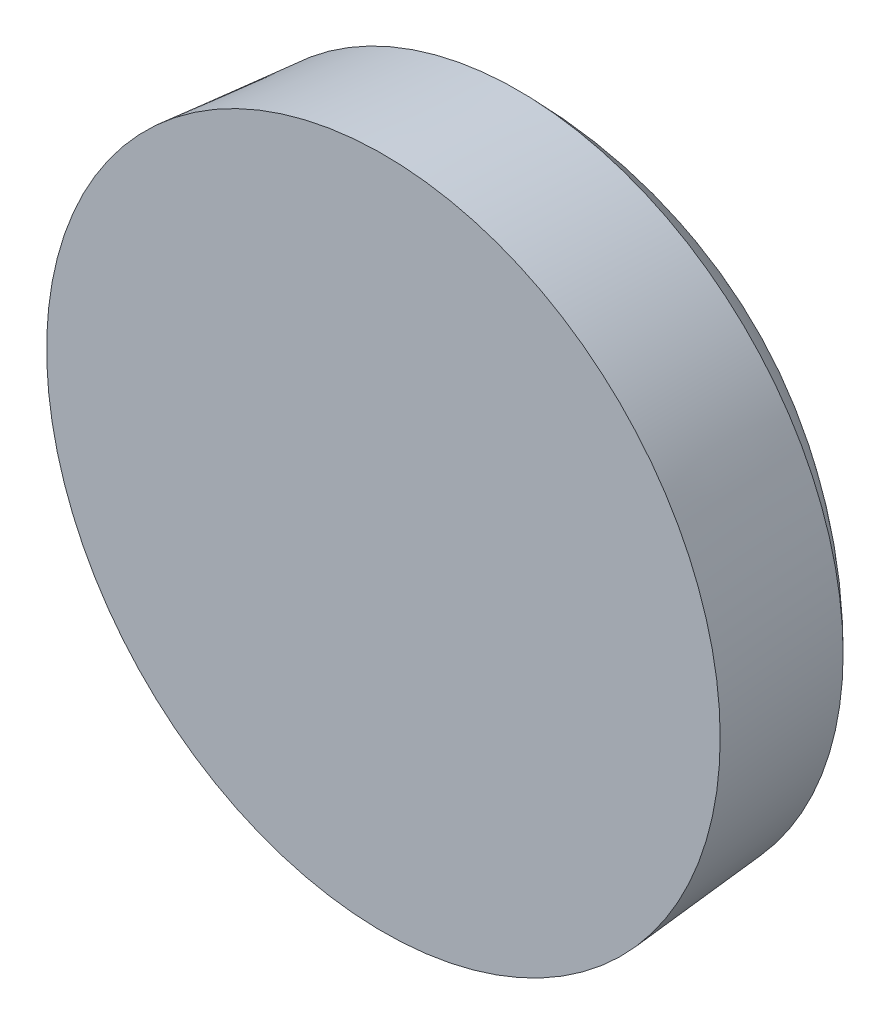
ISO-10303-21;
HEADER;
FILE_DESCRIPTION(('STEP AP214'),'2;1');
FILE_NAME('part.step','',(''),(''),'','','');
FILE_SCHEMA(('AUTOMOTIVE_DESIGN { 1 0 10303 214 1 1 1 1 }'));
ENDSEC;
DATA;
#1=APPLICATION_CONTEXT('core data for automotive mechanical design processes');
#2=APPLICATION_PROTOCOL_DEFINITION('international standard','automotive_design',2000,#1);
#3=PRODUCT_CONTEXT('',#1,'mechanical');
#4=PRODUCT('Part','Part','',(#3));
#5=PRODUCT_RELATED_PRODUCT_CATEGORY('part','',(#4));
#6=PRODUCT_DEFINITION_FORMATION('','',#4);
#7=PRODUCT_DEFINITION_CONTEXT('part definition',#1,'design');
#8=PRODUCT_DEFINITION('design','',#6,#7);
#9=PRODUCT_DEFINITION_SHAPE('','',#8);
#10=(LENGTH_UNIT() NAMED_UNIT(*) SI_UNIT(.MILLI.,.METRE.));
#11=(NAMED_UNIT(*) PLANE_ANGLE_UNIT() SI_UNIT($,.RADIAN.));
#12=(NAMED_UNIT(*) SI_UNIT($,.STERADIAN.) SOLID_ANGLE_UNIT());
#13=UNCERTAINTY_MEASURE_WITH_UNIT(LENGTH_MEASURE(1.E-05),#10,'distance_accuracy_value','');
#14=(GEOMETRIC_REPRESENTATION_CONTEXT(3) GLOBAL_UNCERTAINTY_ASSIGNED_CONTEXT((#13)) GLOBAL_UNIT_ASSIGNED_CONTEXT((#10,
#11,#12)) REPRESENTATION_CONTEXT('',''));
#15=CARTESIAN_POINT('',(0.,0.,0.));
#16=DIRECTION('',(0.,0.,1.));
#17=DIRECTION('',(1.,0.,0.));
#18=AXIS2_PLACEMENT_3D('',#15,#16,#17);
#19=CARTESIAN_POINT('',(-6.89997712496555,4.50501230247056,-21.6));
#20=DIRECTION('',(0.,0.,-1.));
#21=DIRECTION('',(0.,1.,0.));
#22=AXIS2_PLACEMENT_3D('',#19,#20,#21);
#23=PLANE('',#22);
#24=DIRECTION('',(0.747876143588401,0.66383828893138,0.));
#25=VECTOR('',#24,1.);
#26=CARTESIAN_POINT('',(-7.0194680169732,4.63963000831647,-21.6));
#27=LINE('',#26,#25);
#28=CARTESIAN_POINT('',(-7.15408572281911,4.52013911630882,-21.6));
#29=VERTEX_POINT('',#28);
#30=CARTESIAN_POINT('',(-7.72995035338218,4.00898363383166,-21.6));
#31=VERTEX_POINT('',#30);
#32=EDGE_CURVE('E84',#29,#31,#27,.F.);
#33=ORIENTED_EDGE('',*,*,#32,.F.);
#34=DIRECTION('',(-0.66383828893138,0.747876143588401,0.));
#35=VECTOR('',#34,1.);
#36=CARTESIAN_POINT('',(-7.03459483081146,4.38552141046291,-21.6));
#37=LINE('',#36,#35);
#38=CARTESIAN_POINT('',(-7.66524120529627,5.09600374687189,-21.6));
#39=VERTEX_POINT('',#38);
#40=EDGE_CURVE('E89',#39,#29,#37,.F.);
#41=ORIENTED_EDGE('',*,*,#40,.F.);
#42=DIRECTION('',(0.747876143588401,0.66383828893138,0.));
#43=VECTOR('',#42,1.);
#44=CARTESIAN_POINT('',(-7.53062349945036,5.21549463887954,-21.6));
#45=LINE('',#44,#43);
#46=CARTESIAN_POINT('',(-7.39600579360445,5.33498553088719,-21.6));
#47=VERTEX_POINT('',#46);
#48=EDGE_CURVE('E140',#47,#39,#45,.F.);
#49=ORIENTED_EDGE('',*,*,#48,.F.);
#50=DIRECTION('',(0.66383828893138,-0.747876143588401,0.));
#51=VECTOR('',#50,1.);
#52=CARTESIAN_POINT('',(-6.76535941911964,4.62450319447821,-21.6));
#53=LINE('',#52,#51);
#54=CARTESIAN_POINT('',(-6.88485031112729,4.75912090032412,-21.6));
#55=VERTEX_POINT('',#54);
#56=EDGE_CURVE('E151',#55,#47,#53,.F.);
#57=ORIENTED_EDGE('',*,*,#56,.F.);
#58=DIRECTION('',(0.747876143588401,0.66383828893138,0.));
#59=VECTOR('',#58,1.);
#60=CARTESIAN_POINT('',(-7.0194680169732,4.63963000831647,-21.6));
#61=LINE('',#60,#59);
#62=CARTESIAN_POINT('',(-6.30898568056422,5.27027638280128,-21.6));
#63=VERTEX_POINT('',#62);
#64=EDGE_CURVE('E154',#63,#55,#61,.F.);
#65=ORIENTED_EDGE('',*,*,#64,.F.);
#66=DIRECTION('',(0.66383828893138,-0.747876143588401,0.));
#67=VECTOR('',#66,1.);
#68=CARTESIAN_POINT('',(-6.18949478855657,5.13565867695537,-21.6));
#69=LINE('',#68,#67);
#70=CARTESIAN_POINT('',(-6.07000389654892,5.00104097110946,-21.6));
#71=VERTEX_POINT('',#70);
#72=EDGE_CURVE('E162',#71,#63,#69,.F.);
#73=ORIENTED_EDGE('',*,*,#72,.F.);
#74=DIRECTION('',(-0.747876143588401,-0.66383828893138,0.));
#75=VECTOR('',#74,1.);
#76=CARTESIAN_POINT('',(-6.7804862329579,4.37039459662465,-21.6));
#77=LINE('',#76,#75);
#78=CARTESIAN_POINT('',(-6.64586852711199,4.4898854886323,-21.6));
#79=VERTEX_POINT('',#78);
#80=EDGE_CURVE('E167',#79,#71,#77,.F.);
#81=ORIENTED_EDGE('',*,*,#80,.F.);
#82=DIRECTION('',(0.66383828893138,-0.747876143588401,0.));
#83=VECTOR('',#82,1.);
#84=CARTESIAN_POINT('',(-6.76535941911964,4.62450319447821,-21.6));
#85=LINE('',#84,#83);
#86=CARTESIAN_POINT('',(-6.13471304463483,3.91402085806923,-21.6));
#87=VERTEX_POINT('',#86);
#88=EDGE_CURVE('E172',#87,#79,#85,.F.);
#89=ORIENTED_EDGE('',*,*,#88,.F.);
#90=DIRECTION('',(0.747876143588401,0.66383828893138,0.));
#91=VECTOR('',#90,1.);
#92=CARTESIAN_POINT('',(-6.26933075048074,3.79452996606158,-21.6));
#93=LINE('',#92,#91);
#94=CARTESIAN_POINT('',(-6.40394845632666,3.67503907405393,-21.6));
#95=VERTEX_POINT('',#94);
#96=EDGE_CURVE('E178',#87,#95,#93,.F.);
#97=ORIENTED_EDGE('',*,*,#96,.T.);
#98=DIRECTION('',(-0.66383828893138,0.747876143588401,0.));
#99=VECTOR('',#98,1.);
#100=CARTESIAN_POINT('',(-7.03459483081146,4.38552141046291,-21.6));
#101=LINE('',#100,#99);
#102=CARTESIAN_POINT('',(-6.91510393880381,4.250903704617,-21.6));
#103=VERTEX_POINT('',#102);
#104=EDGE_CURVE('E183',#103,#95,#101,.F.);
#105=ORIENTED_EDGE('',*,*,#104,.F.);
#106=DIRECTION('',(-0.747876143588401,-0.66383828893138,0.));
#107=VECTOR('',#106,1.);
#108=CARTESIAN_POINT('',(-6.7804862329579,4.37039459662465,-21.6));
#109=LINE('',#108,#107);
#110=CARTESIAN_POINT('',(-7.49096856936688,3.73974822213984,-21.6));
#111=VERTEX_POINT('',#110);
#112=EDGE_CURVE('E119',#111,#103,#109,.F.);
#113=ORIENTED_EDGE('',*,*,#112,.F.);
#114=DIRECTION('',(0.66383828893138,-0.747876143588401,0.));
#115=VECTOR('',#114,1.);
#116=CARTESIAN_POINT('',(-7.61045946137453,3.87436592798575,-21.6));
#117=LINE('',#116,#115);
#118=EDGE_CURVE('E117',#111,#31,#117,.F.);
#119=ORIENTED_EDGE('',*,*,#118,.T.);
#120=EDGE_LOOP('',(#33,#41,#49,#57,#65,#73,#81,#89,#97,#105,#113,#119));
#121=FACE_BOUND('',#120,.T.);
#122=ADVANCED_FACE('F17',(#121),#23,.T.);
#123=CARTESIAN_POINT('',(-7.0194680169732,4.63963000831647,-22.2));
#124=DIRECTION('',(0.66383828893138,-0.747876143588401,0.));
#125=DIRECTION('',(0.747876143588401,0.66383828893138,0.));
#126=AXIS2_PLACEMENT_3D('',#123,#124,#125);
#127=PLANE('',#126);
#128=DIRECTION('',(0.,0.,1.));
#129=VECTOR('',#128,1.);
#130=CARTESIAN_POINT('',(-7.15408572281911,4.52013911630882,-22.2));
#131=LINE('',#130,#129);
#132=CARTESIAN_POINT('',(-7.15408572281911,4.52013911630882,-22.788097569794));
#133=VERTEX_POINT('',#132);
#134=EDGE_CURVE('E127',#29,#133,#131,.F.);
#135=ORIENTED_EDGE('',*,*,#134,.F.);
#136=ORIENTED_EDGE('',*,*,#32,.T.);
#137=DIRECTION('',(0.,0.,1.));
#138=VECTOR('',#137,1.);
#139=CARTESIAN_POINT('',(-7.72995035338218,4.00898363383166,-22.2));
#140=LINE('',#139,#138);
#141=CARTESIAN_POINT('',(-7.72995035338218,4.00898363383166,-22.6229045231911));
#142=VERTEX_POINT('',#141);
#143=EDGE_CURVE('E123',#31,#142,#140,.F.);
#144=ORIENTED_EDGE('',*,*,#143,.T.);
#145=CARTESIAN_POINT('',(-7.15408572281911,4.52013911630882,-22.788097569794));
#146=CARTESIAN_POINT('',(-7.178771656599,4.49822710830909,-22.7859104299673));
#147=CARTESIAN_POINT('',(-7.20342772135599,4.47634161298961,-22.7831210421487));
#148=CARTESIAN_POINT('',(-7.25255070327682,4.43273851567851,-22.7763560552392));
#149=CARTESIAN_POINT('',(-7.27701798297534,4.41102059188977,-22.7723851623111));
#150=CARTESIAN_POINT('',(-7.32576464164366,4.36775153088425,-22.7632701136372));
#151=CARTESIAN_POINT('',(-7.35004434494988,4.3462001057763,-22.7581290588921));
#152=CARTESIAN_POINT('',(-7.39841672115628,4.30326326960671,-22.7466823115268));
#153=CARTESIAN_POINT('',(-7.42250959829504,4.2818776772565,-22.7403781619621));
#154=CARTESIAN_POINT('',(-7.47050909335735,4.23927182206925,-22.7266089835755));
#155=CARTESIAN_POINT('',(-7.49441571128089,4.2180515592322,-22.7191439547536));
#156=CARTESIAN_POINT('',(-7.5420428123996,4.17577625257286,-22.703052205587));
#157=CARTESIAN_POINT('',(-7.56576300849104,4.15472146359282,-22.6944239659575));
#158=CARTESIAN_POINT('',(-7.61301615058749,4.11277809467423,-22.6760004253173));
#159=CARTESIAN_POINT('',(-7.63654844108106,4.09189009658817,-22.666202118307));
#160=CARTESIAN_POINT('',(-7.68342385204351,4.05028201365486,-22.6454289197685));
#161=CARTESIAN_POINT('',(-7.70676585941599,4.02956291682684,-22.6344495373844));
#162=CARTESIAN_POINT('',(-7.72995035338216,4.00898363383167,-22.622904523191));
#163=B_SPLINE_CURVE_WITH_KNOTS('',3,(#145,#146,#147,#148,#149,#150,#151,#152,#153,#154,#155,
#156,#157,#158,#159,#160,#161,#162),.UNSPECIFIED.,.F.,.F.,(4,2,2,2,2,2,2,2,4),(0.,
0.0992357442434152,0.198081387639265,0.296668072480489,0.395124892694088,0.493581712907687,
0.592168397748912,0.69101404114476,0.790249785388176),.UNSPECIFIED.);
#164=EDGE_CURVE('E20',#133,#142,#163,.T.);
#165=ORIENTED_EDGE('',*,*,#164,.F.);
#166=EDGE_LOOP('',(#135,#136,#144,#165));
#167=FACE_BOUND('',#166,.T.);
#168=ADVANCED_FACE('F125',(#167),#127,.T.);
#169=CARTESIAN_POINT('',(-7.61045946137453,3.87436592798575,-22.2));
#170=DIRECTION('',(-0.747876143588401,-0.66383828893138,0.));
#171=DIRECTION('',(0.66383828893138,-0.747876143588401,0.));
#172=AXIS2_PLACEMENT_3D('',#169,#170,#171);
#173=PLANE('',#172);
#174=ORIENTED_EDGE('',*,*,#118,.F.);
#175=DIRECTION('',(0.,0.,1.));
#176=VECTOR('',#175,1.);
#177=CARTESIAN_POINT('',(-7.49096856936688,3.73974822213984,-22.2));
#178=LINE('',#177,#176);
#179=CARTESIAN_POINT('',(-7.49096856936687,3.73974822213984,-22.6229045231911));
#180=VERTEX_POINT('',#179);
#181=EDGE_CURVE('E132',#180,#111,#178,.T.);
#182=ORIENTED_EDGE('',*,*,#181,.F.);
#183=CARTESIAN_POINT('',(-7.72995035338218,4.00898363383166,-22.622904523191));
#184=CARTESIAN_POINT('',(-7.6901200560463,3.96411106521635,-22.6271329188894));
#185=CARTESIAN_POINT('',(-7.65028975871041,3.91923849660105,-22.6292471167385));
#186=CARTESIAN_POINT('',(-7.57062916403865,3.82949335937045,-22.6292471167385));
#187=CARTESIAN_POINT('',(-7.53079886670276,3.78462079075515,-22.6271329188894));
#188=CARTESIAN_POINT('',(-7.49096856936688,3.73974822213984,-22.622904523191));
#189=B_SPLINE_CURVE_WITH_KNOTS('',3,(#183,#184,#185,#186,#187,#188),.UNSPECIFIED.,.F.,.F.,(4,2,
4),(0.,0.180111711148685,0.36022342229737),.UNSPECIFIED.);
#190=EDGE_CURVE('E131',#142,#180,#189,.T.);
#191=ORIENTED_EDGE('',*,*,#190,.F.);
#192=ORIENTED_EDGE('',*,*,#143,.F.);
#193=EDGE_LOOP('',(#174,#182,#191,#192));
#194=FACE_BOUND('',#193,.T.);
#195=ADVANCED_FACE('F129',(#194),#173,.F.);
#196=CARTESIAN_POINT('',(-6.7804862329579,4.37039459662465,-22.2));
#197=DIRECTION('',(-0.66383828893138,0.747876143588401,0.));
#198=DIRECTION('',(-0.747876143588401,-0.66383828893138,0.));
#199=AXIS2_PLACEMENT_3D('',#196,#197,#198);
#200=PLANE('',#199);
#201=DIRECTION('',(0.,0.,1.));
#202=VECTOR('',#201,1.);
#203=CARTESIAN_POINT('',(-6.91510393880381,4.250903704617,-22.2));
#204=LINE('',#203,#202);
#205=CARTESIAN_POINT('',(-6.91510393880381,4.250903704617,-22.788097569794));
#206=VERTEX_POINT('',#205);
#207=EDGE_CURVE('E180',#206,#103,#204,.T.);
#208=ORIENTED_EDGE('',*,*,#207,.F.);
#209=CARTESIAN_POINT('',(-7.49096856936686,3.73974822213985,-22.622904523191));
#210=CARTESIAN_POINT('',(-7.46778407540069,3.76032750513502,-22.6344495373844));
#211=CARTESIAN_POINT('',(-7.44444206802821,3.78104660196304,-22.6454289197685));
#212=CARTESIAN_POINT('',(-7.39756665706576,3.82265468489635,-22.666202118307));
#213=CARTESIAN_POINT('',(-7.37403436657219,3.84354268298241,-22.6760004253173));
#214=CARTESIAN_POINT('',(-7.32678122447574,3.885486051901,-22.6944239659575));
#215=CARTESIAN_POINT('',(-7.3030610283843,3.90654084088104,-22.703052205587));
#216=CARTESIAN_POINT('',(-7.25543392726559,3.94881614754038,-22.7191439547536));
#217=CARTESIAN_POINT('',(-7.23152730934205,3.97003641037742,-22.7266089835755));
#218=CARTESIAN_POINT('',(-7.18352781427975,4.01264226556468,-22.7403781619621));
#219=CARTESIAN_POINT('',(-7.15943493714099,4.03402785791489,-22.7466823115268));
#220=CARTESIAN_POINT('',(-7.11106256093458,4.07696469408448,-22.7581290588921));
#221=CARTESIAN_POINT('',(-7.08678285762836,4.09851611919243,-22.7632701136372));
#222=CARTESIAN_POINT('',(-7.03803619896004,4.14178518019794,-22.7723851623111));
#223=CARTESIAN_POINT('',(-7.01356891926152,4.16350310398668,-22.7763560552392));
#224=CARTESIAN_POINT('',(-6.96444593734069,4.20710620129778,-22.7831210421487));
#225=CARTESIAN_POINT('',(-6.93978987258371,4.22899169661726,-22.7859104299673));
#226=CARTESIAN_POINT('',(-6.91510393880381,4.250903704617,-22.788097569794));
#227=B_SPLINE_CURVE_WITH_KNOTS('',3,(#209,#210,#211,#212,#213,#214,#215,#216,#217,#218,#219,
#220,#221,#222,#223,#224,#225,#226),.UNSPECIFIED.,.F.,.F.,(4,2,2,2,2,2,2,2,4),(0.,
0.0992357442434142,0.198081387639263,0.296668072480487,0.395124892694086,0.493581712907683,
0.592168397748908,0.691014041144757,0.790249785388171),.UNSPECIFIED.);
#228=EDGE_CURVE('E296',#180,#206,#227,.T.);
#229=ORIENTED_EDGE('',*,*,#228,.F.);
#230=ORIENTED_EDGE('',*,*,#181,.T.);
#231=ORIENTED_EDGE('',*,*,#112,.T.);
#232=EDGE_LOOP('',(#208,#229,#230,#231));
#233=FACE_BOUND('',#232,.T.);
#234=ADVANCED_FACE('F305',(#233),#200,.T.);
#235=CARTESIAN_POINT('',(-7.03459483081146,4.38552141046291,-22.2));
#236=DIRECTION('',(0.747876143588401,0.66383828893138,0.));
#237=DIRECTION('',(-0.66383828893138,0.747876143588401,0.));
#238=AXIS2_PLACEMENT_3D('',#235,#236,#237);
#239=PLANE('',#238);
#240=CARTESIAN_POINT('',(-6.91510393880381,4.250903704617,-22.788097569794));
#241=CARTESIAN_POINT('',(-6.89319193080408,4.2262177708371,-22.7859104299673));
#242=CARTESIAN_POINT('',(-6.8713064354846,4.20156170608012,-22.7831210421487));
#243=CARTESIAN_POINT('',(-6.8277033381735,4.15243872415929,-22.7763560552392));
#244=CARTESIAN_POINT('',(-6.80598541438476,4.12797144446077,-22.7723851623111));
#245=CARTESIAN_POINT('',(-6.76271635337924,4.07922478579245,-22.7632701136372));
#246=CARTESIAN_POINT('',(-6.7411649282713,4.05494508248623,-22.7581290588921));
#247=CARTESIAN_POINT('',(-6.6982280921017,4.00657270627982,-22.7466823115268));
#248=CARTESIAN_POINT('',(-6.67684249975149,3.98247982914107,-22.740378161962));
#249=CARTESIAN_POINT('',(-6.63423664456424,3.93448033407876,-22.7266089835755));
#250=CARTESIAN_POINT('',(-6.61301638172719,3.91057371615522,-22.7191439547536));
#251=CARTESIAN_POINT('',(-6.57074107506785,3.86294661503651,-22.703052205587));
#252=CARTESIAN_POINT('',(-6.54968628608781,3.83922641894507,-22.6944239659575));
#253=CARTESIAN_POINT('',(-6.50774291716923,3.79197327684862,-22.6760004253173));
#254=CARTESIAN_POINT('',(-6.48685491908316,3.76844098635505,-22.666202118307));
#255=CARTESIAN_POINT('',(-6.44524683614985,3.7215655753926,-22.6454289197685));
#256=CARTESIAN_POINT('',(-6.42452773932184,3.69822356802012,-22.6344495373844));
#257=CARTESIAN_POINT('',(-6.40394845632667,3.67503907405395,-22.622904523191));
#258=B_SPLINE_CURVE_WITH_KNOTS('',3,(#240,#241,#242,#243,#244,#245,#246,#247,#248,#249,#250,
#251,#252,#253,#254,#255,#256,#257),.UNSPECIFIED.,.F.,.F.,(4,2,2,2,2,2,2,2,4),(0.,
0.0992357442434143,0.198081387639264,0.296668072480489,0.395124892694086,0.493581712907685,
0.592168397748908,0.691014041144757,0.790249785388172),.UNSPECIFIED.);
#259=CARTESIAN_POINT('',(-6.40394845632665,3.67503907405393,-22.6229045231911));
#260=VERTEX_POINT('',#259);
#261=EDGE_CURVE('E289',#206,#260,#258,.T.);
#262=ORIENTED_EDGE('',*,*,#261,.F.);
#263=ORIENTED_EDGE('',*,*,#207,.T.);
#264=ORIENTED_EDGE('',*,*,#104,.T.);
#265=DIRECTION('',(0.,0.,1.));
#266=VECTOR('',#265,1.);
#267=CARTESIAN_POINT('',(-6.40394845632666,3.67503907405393,-22.2));
#268=LINE('',#267,#266);
#269=EDGE_CURVE('E175',#95,#260,#268,.F.);
#270=ORIENTED_EDGE('',*,*,#269,.T.);
#271=EDGE_LOOP('',(#262,#263,#264,#270));
#272=FACE_BOUND('',#271,.T.);
#273=ADVANCED_FACE('F302',(#272),#239,.T.);
#274=CARTESIAN_POINT('',(-6.26933075048074,3.79452996606158,-22.2));
#275=DIRECTION('',(0.66383828893138,-0.747876143588401,0.));
#276=DIRECTION('',(0.747876143588401,0.66383828893138,0.));
#277=AXIS2_PLACEMENT_3D('',#274,#275,#276);
#278=PLANE('',#277);
#279=ORIENTED_EDGE('',*,*,#96,.F.);
#280=DIRECTION('',(0.,0.,1.));
#281=VECTOR('',#280,1.);
#282=CARTESIAN_POINT('',(-6.13471304463483,3.91402085806923,-22.2));
#283=LINE('',#282,#281);
#284=CARTESIAN_POINT('',(-6.13471304463484,3.91402085806924,-22.6229045231911));
#285=VERTEX_POINT('',#284);
#286=EDGE_CURVE('E174',#285,#87,#283,.T.);
#287=ORIENTED_EDGE('',*,*,#286,.F.);
#288=CARTESIAN_POINT('',(-6.40394845632665,3.67503907405394,-22.622904523191));
#289=CARTESIAN_POINT('',(-6.35907588771134,3.71486937138982,-22.6271329188894));
#290=CARTESIAN_POINT('',(-6.31420331909604,3.7546996687257,-22.6292471167385));
#291=CARTESIAN_POINT('',(-6.22445818186544,3.83436026339746,-22.6292471167385));
#292=CARTESIAN_POINT('',(-6.17958561325013,3.87419056073334,-22.6271329188894));
#293=CARTESIAN_POINT('',(-6.13471304463483,3.91402085806922,-22.622904523191));
#294=B_SPLINE_CURVE_WITH_KNOTS('',3,(#288,#289,#290,#291,#292,#293),.UNSPECIFIED.,.F.,.F.,(4,2,
4),(0.,0.180111711148683,0.360223422297366),.UNSPECIFIED.);
#295=EDGE_CURVE('E282',#260,#285,#294,.T.);
#296=ORIENTED_EDGE('',*,*,#295,.F.);
#297=ORIENTED_EDGE('',*,*,#269,.F.);
#298=EDGE_LOOP('',(#279,#287,#296,#297));
#299=FACE_BOUND('',#298,.T.);
#300=ADVANCED_FACE('F271',(#299),#278,.F.);
#301=CARTESIAN_POINT('',(-6.76535941911964,4.62450319447821,-22.2));
#302=DIRECTION('',(-0.747876143588401,-0.66383828893138,0.));
#303=DIRECTION('',(0.66383828893138,-0.747876143588401,0.));
#304=AXIS2_PLACEMENT_3D('',#301,#302,#303);
#305=PLANE('',#304);
#306=CARTESIAN_POINT('',(-6.13471304463484,3.91402085806925,-22.622904523191));
#307=CARTESIAN_POINT('',(-6.15529232763002,3.93720535203542,-22.6344495373844));
#308=CARTESIAN_POINT('',(-6.17601142445803,3.9605473594079,-22.6454289197685));
#309=CARTESIAN_POINT('',(-6.21761950739134,4.00742277037035,-22.666202118307));
#310=CARTESIAN_POINT('',(-6.23850750547741,4.03095506086392,-22.6760004253173));
#311=CARTESIAN_POINT('',(-6.28045087439599,4.07820820296037,-22.6944239659575));
#312=CARTESIAN_POINT('',(-6.30150566337603,4.10192839905181,-22.703052205587));
#313=CARTESIAN_POINT('',(-6.34378097003537,4.14955550017052,-22.7191439547536));
#314=CARTESIAN_POINT('',(-6.36500123287242,4.17346211809406,-22.7266089835755));
#315=CARTESIAN_POINT('',(-6.40760708805967,4.22146161315637,-22.740378161962));
#316=CARTESIAN_POINT('',(-6.42899268040988,4.24555449029512,-22.7466823115268));
#317=CARTESIAN_POINT('',(-6.47192951657947,4.29392686650153,-22.7581290588921));
#318=CARTESIAN_POINT('',(-6.49348094168742,4.31820656980775,-22.7632701136372));
#319=CARTESIAN_POINT('',(-6.53675000269294,4.36695322847607,-22.7723851623111));
#320=CARTESIAN_POINT('',(-6.55846792648168,4.39142050817459,-22.7763560552392));
#321=CARTESIAN_POINT('',(-6.60207102379277,4.44054349009542,-22.7831210421487));
#322=CARTESIAN_POINT('',(-6.62395651911226,4.4651995548524,-22.7859104299673));
#323=CARTESIAN_POINT('',(-6.64586852711199,4.4898854886323,-22.788097569794));
#324=B_SPLINE_CURVE_WITH_KNOTS('',3,(#306,#307,#308,#309,#310,#311,#312,#313,#314,#315,#316,
#317,#318,#319,#320,#321,#322,#323),.UNSPECIFIED.,.F.,.F.,(4,2,2,2,2,2,2,2,4),(0.,
0.0992357442434162,0.198081387639263,0.296668072480487,0.395124892694085,0.493581712907681,
0.592168397748907,0.691014041144756,0.790249785388171),.UNSPECIFIED.);
#325=CARTESIAN_POINT('',(-6.64586852711199,4.4898854886323,-22.788097569794));
#326=VERTEX_POINT('',#325);
#327=EDGE_CURVE('E275',#285,#326,#324,.T.);
#328=ORIENTED_EDGE('',*,*,#327,.F.);
#329=ORIENTED_EDGE('',*,*,#286,.T.);
#330=ORIENTED_EDGE('',*,*,#88,.T.);
#331=DIRECTION('',(0.,0.,1.));
#332=VECTOR('',#331,1.);
#333=CARTESIAN_POINT('',(-6.64586852711199,4.4898854886323,-22.2));
#334=LINE('',#333,#332);
#335=EDGE_CURVE('E169',#326,#79,#334,.T.);
#336=ORIENTED_EDGE('',*,*,#335,.F.);
#337=EDGE_LOOP('',(#328,#329,#330,#336));
#338=FACE_BOUND('',#337,.T.);
#339=ADVANCED_FACE('F266',(#338),#305,.T.);
#340=CARTESIAN_POINT('',(-6.7804862329579,4.37039459662465,-22.2));
#341=DIRECTION('',(-0.66383828893138,0.747876143588401,0.));
#342=DIRECTION('',(-0.747876143588401,-0.66383828893138,0.));
#343=AXIS2_PLACEMENT_3D('',#340,#341,#342);
#344=PLANE('',#343);
#345=ORIENTED_EDGE('',*,*,#335,.T.);
#346=ORIENTED_EDGE('',*,*,#80,.T.);
#347=DIRECTION('',(0.,0.,1.));
#348=VECTOR('',#347,1.);
#349=CARTESIAN_POINT('',(-6.07000389654892,5.00104097110945,-22.2));
#350=LINE('',#349,#348);
#351=CARTESIAN_POINT('',(-6.07000389654892,5.00104097110945,-22.6229045231911));
#352=VERTEX_POINT('',#351);
#353=EDGE_CURVE('E164',#352,#71,#350,.T.);
#354=ORIENTED_EDGE('',*,*,#353,.F.);
#355=CARTESIAN_POINT('',(-6.64586852711199,4.4898854886323,-22.788097569794));
#356=CARTESIAN_POINT('',(-6.62118259333209,4.51179749663203,-22.7859104299673));
#357=CARTESIAN_POINT('',(-6.59652652857511,4.53368299195151,-22.7831210421487));
#358=CARTESIAN_POINT('',(-6.54740354665428,4.57728608926261,-22.7763560552392));
#359=CARTESIAN_POINT('',(-6.52293626695576,4.59900401305135,-22.7723851623111));
#360=CARTESIAN_POINT('',(-6.47418960828744,4.64227307405686,-22.7632701136372));
#361=CARTESIAN_POINT('',(-6.44990990498122,4.66382449916481,-22.7581290588921));
#362=CARTESIAN_POINT('',(-6.40153752877482,4.70676133533441,-22.7466823115268));
#363=CARTESIAN_POINT('',(-6.37744465163606,4.72814692768462,-22.740378161962));
#364=CARTESIAN_POINT('',(-6.32944515657376,4.77075278287187,-22.7266089835755));
#365=CARTESIAN_POINT('',(-6.30553853865021,4.79197304570891,-22.7191439547536));
#366=CARTESIAN_POINT('',(-6.25791143753151,4.83424835236825,-22.703052205587));
#367=CARTESIAN_POINT('',(-6.23419124144006,4.85530314134829,-22.6944239659575));
#368=CARTESIAN_POINT('',(-6.18693809934362,4.89724651026688,-22.6760004253173));
#369=CARTESIAN_POINT('',(-6.16340580885004,4.91813450835295,-22.666202118307));
#370=CARTESIAN_POINT('',(-6.11653039788759,4.95974259128625,-22.6454289197685));
#371=CARTESIAN_POINT('',(-6.09318839051511,4.98046168811427,-22.6344495373844));
#372=CARTESIAN_POINT('',(-6.07000389654894,5.00104097110944,-22.622904523191));
#373=B_SPLINE_CURVE_WITH_KNOTS('',3,(#355,#356,#357,#358,#359,#360,#361,#362,#363,#364,#365,
#366,#367,#368,#369,#370,#371,#372),.UNSPECIFIED.,.F.,.F.,(4,2,2,2,2,2,2,2,4),(0.,
0.0992357442434131,0.198081387639263,0.296668072480486,0.395124892694083,0.49358171290768,
0.592168397748905,0.691014041144752,0.790249785388167),.UNSPECIFIED.);
#374=EDGE_CURVE('E251',#326,#352,#373,.T.);
#375=ORIENTED_EDGE('',*,*,#374,.F.);
#376=EDGE_LOOP('',(#345,#346,#354,#375));
#377=FACE_BOUND('',#376,.T.);
#378=ADVANCED_FACE('F261',(#377),#344,.T.);
#379=CARTESIAN_POINT('',(-6.18949478855657,5.13565867695537,-22.2));
#380=DIRECTION('',(-0.747876143588401,-0.66383828893138,0.));
#381=DIRECTION('',(0.66383828893138,-0.747876143588401,0.));
#382=AXIS2_PLACEMENT_3D('',#379,#380,#381);
#383=PLANE('',#382);
#384=ORIENTED_EDGE('',*,*,#353,.T.);
#385=ORIENTED_EDGE('',*,*,#72,.T.);
#386=DIRECTION('',(0.,0.,1.));
#387=VECTOR('',#386,1.);
#388=CARTESIAN_POINT('',(-6.30898568056422,5.27027638280128,-22.2));
#389=LINE('',#388,#387);
#390=CARTESIAN_POINT('',(-6.30898568056423,5.27027638280127,-22.6229045231911));
#391=VERTEX_POINT('',#390);
#392=EDGE_CURVE('E159',#391,#63,#389,.T.);
#393=ORIENTED_EDGE('',*,*,#392,.F.);
#394=CARTESIAN_POINT('',(-6.07000389654892,5.00104097110946,-22.622904523191));
#395=CARTESIAN_POINT('',(-6.1098341938848,5.04591353972476,-22.6271329188894));
#396=CARTESIAN_POINT('',(-6.14966449122069,5.09078610834006,-22.6292471167385));
#397=CARTESIAN_POINT('',(-6.22932508589245,5.18053124557067,-22.6292471167385));
#398=CARTESIAN_POINT('',(-6.26915538322833,5.22540381418597,-22.6271329188894));
#399=CARTESIAN_POINT('',(-6.30898568056421,5.27027638280128,-22.622904523191));
#400=B_SPLINE_CURVE_WITH_KNOTS('',3,(#394,#395,#396,#397,#398,#399),.UNSPECIFIED.,.F.,.F.,(4,2,
4),(0.,0.180111711148686,0.36022342229737),.UNSPECIFIED.);
#401=EDGE_CURVE('E244',#352,#391,#400,.T.);
#402=ORIENTED_EDGE('',*,*,#401,.F.);
#403=EDGE_LOOP('',(#384,#385,#393,#402));
#404=FACE_BOUND('',#403,.T.);
#405=ADVANCED_FACE('F258',(#404),#383,.T.);
#406=CARTESIAN_POINT('',(-7.0194680169732,4.63963000831647,-22.2));
#407=DIRECTION('',(0.66383828893138,-0.747876143588401,0.));
#408=DIRECTION('',(0.747876143588401,0.66383828893138,0.));
#409=AXIS2_PLACEMENT_3D('',#406,#407,#408);
#410=PLANE('',#409);
#411=DIRECTION('',(0.,0.,1.));
#412=VECTOR('',#411,1.);
#413=CARTESIAN_POINT('',(-6.88485031112729,4.75912090032412,-22.2));
#414=LINE('',#413,#412);
#415=CARTESIAN_POINT('',(-6.88485031112729,4.75912090032412,-22.788097569794));
#416=VERTEX_POINT('',#415);
#417=EDGE_CURVE('E143',#416,#55,#414,.T.);
#418=ORIENTED_EDGE('',*,*,#417,.F.);
#419=CARTESIAN_POINT('',(-6.30898568056423,5.27027638280126,-22.622904523191));
#420=CARTESIAN_POINT('',(-6.33217017453041,5.24969709980609,-22.6344495373844));
#421=CARTESIAN_POINT('',(-6.35551218190288,5.22897800297808,-22.6454289197685));
#422=CARTESIAN_POINT('',(-6.40238759286534,5.18736992004477,-22.666202118307));
#423=CARTESIAN_POINT('',(-6.42591988335891,5.1664819219587,-22.6760004253173));
#424=CARTESIAN_POINT('',(-6.47317302545536,5.12453855304012,-22.6944239659575));
#425=CARTESIAN_POINT('',(-6.4968932215468,5.10348376406008,-22.703052205587));
#426=CARTESIAN_POINT('',(-6.54452032266551,5.06120845740074,-22.7191439547536));
#427=CARTESIAN_POINT('',(-6.56842694058905,5.03998819456369,-22.7266089835755));
#428=CARTESIAN_POINT('',(-6.61642643565135,4.99738233937644,-22.740378161962));
#429=CARTESIAN_POINT('',(-6.64051931279011,4.97599674702623,-22.7466823115268));
#430=CARTESIAN_POINT('',(-6.68889168899652,4.93305991085663,-22.7581290588921));
#431=CARTESIAN_POINT('',(-6.71317139230274,4.91150848574869,-22.7632701136372));
#432=CARTESIAN_POINT('',(-6.76191805097105,4.86823942474317,-22.7723851623111));
#433=CARTESIAN_POINT('',(-6.78638533066957,4.84652150095443,-22.7763560552392));
#434=CARTESIAN_POINT('',(-6.83550831259041,4.80291840364333,-22.7831210421487));
#435=CARTESIAN_POINT('',(-6.86016437734739,4.78103290832385,-22.7859104299673));
#436=CARTESIAN_POINT('',(-6.88485031112728,4.75912090032412,-22.788097569794));
#437=B_SPLINE_CURVE_WITH_KNOTS('',3,(#419,#420,#421,#422,#423,#424,#425,#426,#427,#428,#429,
#430,#431,#432,#433,#434,#435,#436),.UNSPECIFIED.,.F.,.F.,(4,2,2,2,2,2,2,2,4),(0.,
0.0992357442434147,0.198081387639264,0.296668072480487,0.395124892694086,0.493581712907684,
0.592168397748908,0.691014041144756,0.790249785388172),.UNSPECIFIED.);
#438=EDGE_CURVE('E237',#391,#416,#437,.T.);
#439=ORIENTED_EDGE('',*,*,#438,.F.);
#440=ORIENTED_EDGE('',*,*,#392,.T.);
#441=ORIENTED_EDGE('',*,*,#64,.T.);
#442=EDGE_LOOP('',(#418,#439,#440,#441));
#443=FACE_BOUND('',#442,.T.);
#444=ADVANCED_FACE('F226',(#443),#410,.T.);
#445=CARTESIAN_POINT('',(-6.76535941911964,4.62450319447821,-22.2));
#446=DIRECTION('',(-0.747876143588401,-0.66383828893138,0.));
#447=DIRECTION('',(0.66383828893138,-0.747876143588401,0.));
#448=AXIS2_PLACEMENT_3D('',#445,#446,#447);
#449=PLANE('',#448);
#450=CARTESIAN_POINT('',(-6.88485031112729,4.75912090032412,-22.788097569794));
#451=CARTESIAN_POINT('',(-6.90676231912702,4.78380683410402,-22.7859104299673));
#452=CARTESIAN_POINT('',(-6.9286478144465,4.808462898861,-22.7831210421487));
#453=CARTESIAN_POINT('',(-6.9722509117576,4.85758588078183,-22.7763560552392));
#454=CARTESIAN_POINT('',(-6.99396883554634,4.88205316048035,-22.7723851623111));
#455=CARTESIAN_POINT('',(-7.03723789655185,4.93079981914866,-22.7632701136372));
#456=CARTESIAN_POINT('',(-7.0587893216598,4.95507952245489,-22.7581290588921));
#457=CARTESIAN_POINT('',(-7.1017261578294,5.00345189866129,-22.7466823115268));
#458=CARTESIAN_POINT('',(-7.1231117501796,5.02754477580005,-22.7403781619621));
#459=CARTESIAN_POINT('',(-7.16571760536686,5.07554427086235,-22.7266089835755));
#460=CARTESIAN_POINT('',(-7.1869378682039,5.0994508887859,-22.7191439547536));
#461=CARTESIAN_POINT('',(-7.22921317486324,5.1470779899046,-22.703052205587));
#462=CARTESIAN_POINT('',(-7.25026796384328,5.17079818599605,-22.6944239659575));
#463=CARTESIAN_POINT('',(-7.29221133276187,5.21805132809249,-22.6760004253173));
#464=CARTESIAN_POINT('',(-7.31309933084793,5.24158361858607,-22.666202118307));
#465=CARTESIAN_POINT('',(-7.35470741378124,5.28845902954852,-22.6454289197685));
#466=CARTESIAN_POINT('',(-7.37542651060926,5.31180103692099,-22.6344495373844));
#467=CARTESIAN_POINT('',(-7.39600579360443,5.33498553088716,-22.622904523191));
#468=B_SPLINE_CURVE_WITH_KNOTS('',3,(#450,#451,#452,#453,#454,#455,#456,#457,#458,#459,#460,
#461,#462,#463,#464,#465,#466,#467),.UNSPECIFIED.,.F.,.F.,(4,2,2,2,2,2,2,2,4),(0.,
0.0992357442434133,0.198081387639262,0.296668072480486,0.395124892694082,0.493581712907679,
0.592168397748903,0.691014041144748,0.790249785388163),.UNSPECIFIED.);
#469=CARTESIAN_POINT('',(-7.39600579360445,5.33498553088718,-22.6229045231911));
#470=VERTEX_POINT('',#469);
#471=EDGE_CURVE('E230',#416,#470,#468,.T.);
#472=ORIENTED_EDGE('',*,*,#471,.F.);
#473=ORIENTED_EDGE('',*,*,#417,.T.);
#474=ORIENTED_EDGE('',*,*,#56,.T.);
#475=DIRECTION('',(0.,0.,1.));
#476=VECTOR('',#475,1.);
#477=CARTESIAN_POINT('',(-7.39600579360445,5.33498553088718,-22.2));
#478=LINE('',#477,#476);
#479=EDGE_CURVE('E142',#470,#47,#478,.T.);
#480=ORIENTED_EDGE('',*,*,#479,.F.);
#481=EDGE_LOOP('',(#472,#473,#474,#480));
#482=FACE_BOUND('',#481,.T.);
#483=ADVANCED_FACE('F222',(#482),#449,.T.);
#484=CARTESIAN_POINT('',(-7.53062349945036,5.21549463887954,-22.2));
#485=DIRECTION('',(0.66383828893138,-0.747876143588401,0.));
#486=DIRECTION('',(0.747876143588401,0.66383828893138,0.));
#487=AXIS2_PLACEMENT_3D('',#484,#485,#486);
#488=PLANE('',#487);
#489=CARTESIAN_POINT('',(-7.39600579360445,5.33498553088718,-22.622904523191));
#490=CARTESIAN_POINT('',(-7.44087836221976,5.2951552335513,-22.6271329188894));
#491=CARTESIAN_POINT('',(-7.48575093083506,5.25532493621542,-22.6292471167385));
#492=CARTESIAN_POINT('',(-7.57549606806566,5.17566434154366,-22.6292471167385));
#493=CARTESIAN_POINT('',(-7.62036863668096,5.13583404420777,-22.6271329188894));
#494=CARTESIAN_POINT('',(-7.66524120529627,5.09600374687189,-22.622904523191));
#495=B_SPLINE_CURVE_WITH_KNOTS('',3,(#489,#490,#491,#492,#493,#494),.UNSPECIFIED.,.F.,.F.,(4,2,
4),(0.,0.180111711148681,0.360223422297362),.UNSPECIFIED.);
#496=CARTESIAN_POINT('',(-7.66524120529626,5.09600374687188,-22.6229045231911));
#497=VERTEX_POINT('',#496);
#498=EDGE_CURVE('E203',#470,#497,#495,.T.);
#499=ORIENTED_EDGE('',*,*,#498,.F.);
#500=ORIENTED_EDGE('',*,*,#479,.T.);
#501=ORIENTED_EDGE('',*,*,#48,.T.);
#502=DIRECTION('',(0.,0.,1.));
#503=VECTOR('',#502,1.);
#504=CARTESIAN_POINT('',(-7.66524120529627,5.09600374687189,-22.2));
#505=LINE('',#504,#503);
#506=EDGE_CURVE('E40',#497,#39,#505,.T.);
#507=ORIENTED_EDGE('',*,*,#506,.F.);
#508=EDGE_LOOP('',(#499,#500,#501,#507));
#509=FACE_BOUND('',#508,.T.);
#510=ADVANCED_FACE('F217',(#509),#488,.T.);
#511=CARTESIAN_POINT('',(-7.03459483081146,4.38552141046291,-22.2));
#512=DIRECTION('',(0.747876143588401,0.66383828893138,0.));
#513=DIRECTION('',(-0.66383828893138,0.747876143588401,0.));
#514=AXIS2_PLACEMENT_3D('',#511,#512,#513);
#515=PLANE('',#514);
#516=CARTESIAN_POINT('',(-7.66524120529626,5.09600374687188,-22.622904523191));
#517=CARTESIAN_POINT('',(-7.64466192230108,5.0728192529057,-22.6344495373844));
#518=CARTESIAN_POINT('',(-7.62394282547307,5.04947724553322,-22.6454289197685));
#519=CARTESIAN_POINT('',(-7.58233474253976,5.00260183457077,-22.666202118307));
#520=CARTESIAN_POINT('',(-7.5614467444537,4.9790695440772,-22.6760004253173));
#521=CARTESIAN_POINT('',(-7.51950337553511,4.93181640198075,-22.6944239659575));
#522=CARTESIAN_POINT('',(-7.49844858655507,4.90809620588931,-22.703052205587));
#523=CARTESIAN_POINT('',(-7.45617327989573,4.8604691047706,-22.7191439547536));
#524=CARTESIAN_POINT('',(-7.43495301705868,4.83656248684706,-22.7266089835755));
#525=CARTESIAN_POINT('',(-7.39234716187143,4.78856299178475,-22.7403781619621));
#526=CARTESIAN_POINT('',(-7.37096156952122,4.764470114646,-22.7466823115268));
#527=CARTESIAN_POINT('',(-7.32802473335162,4.71609773843959,-22.7581290588921));
#528=CARTESIAN_POINT('',(-7.30647330824368,4.69181803513337,-22.7632701136372));
#529=CARTESIAN_POINT('',(-7.26320424723816,4.64307137646505,-22.7723851623111));
#530=CARTESIAN_POINT('',(-7.24148632344942,4.61860409676653,-22.7763560552392));
#531=CARTESIAN_POINT('',(-7.19788322613832,4.5694811148457,-22.7831210421487));
#532=CARTESIAN_POINT('',(-7.17599773081884,4.54482505008871,-22.7859104299673));
#533=CARTESIAN_POINT('',(-7.15408572281911,4.52013911630882,-22.788097569794));
#534=B_SPLINE_CURVE_WITH_KNOTS('',3,(#516,#517,#518,#519,#520,#521,#522,#523,#524,#525,#526,
#527,#528,#529,#530,#531,#532,#533),.UNSPECIFIED.,.F.,.F.,(4,2,2,2,2,2,2,2,4),(0.,
0.0992357442434157,0.198081387639266,0.296668072480491,0.395124892694089,0.493581712907686,
0.592168397748912,0.691014041144763,0.790249785388178),.UNSPECIFIED.);
#535=EDGE_CURVE('E195',#497,#133,#534,.T.);
#536=ORIENTED_EDGE('',*,*,#535,.F.);
#537=ORIENTED_EDGE('',*,*,#506,.T.);
#538=ORIENTED_EDGE('',*,*,#40,.T.);
#539=ORIENTED_EDGE('',*,*,#134,.T.);
#540=EDGE_LOOP('',(#536,#537,#538,#539));
#541=FACE_BOUND('',#540,.T.);
#542=ADVANCED_FACE('F214',(#541),#515,.T.);
#543=CARTESIAN_POINT('',(-6.89997712496556,4.50501230247056,-20.0719156205536));
#544=DIRECTION('',(0.460133509726887,0.667997322687943,0.584856161896373));
#545=DIRECTION('',(0.,0.658733272493448,-0.752376551807719));
#546=AXIS2_PLACEMENT_3D('',#543,#544,#545);
#547=SPHERICAL_SURFACE('',#546,2.72808437944638);
#548=ORIENTED_EDGE('',*,*,#498,.T.);
#549=ORIENTED_EDGE('',*,*,#535,.T.);
#550=ORIENTED_EDGE('',*,*,#164,.T.);
#551=ORIENTED_EDGE('',*,*,#190,.T.);
#552=ORIENTED_EDGE('',*,*,#228,.T.);
#553=ORIENTED_EDGE('',*,*,#261,.T.);
#554=ORIENTED_EDGE('',*,*,#295,.T.);
#555=ORIENTED_EDGE('',*,*,#327,.T.);
#556=ORIENTED_EDGE('',*,*,#374,.T.);
#557=ORIENTED_EDGE('',*,*,#401,.T.);
#558=ORIENTED_EDGE('',*,*,#438,.T.);
#559=ORIENTED_EDGE('',*,*,#471,.T.);
#560=EDGE_LOOP('',(#548,#549,#550,#551,#552,#553,#554,#555,#556,#557,#558,#559));
#561=FACE_BOUND('',#560,.T.);
#562=CARTESIAN_POINT('',(-6.89997712496555,4.50501230247056,-21.9999999999914));
#563=DIRECTION('',(0.,0.,1.));
#564=DIRECTION('',(1.,0.,0.));
#565=AXIS2_PLACEMENT_3D('',#562,#563,#564);
#566=CIRCLE('',#565,1.9300090691825);
#567=CARTESIAN_POINT('',(-4.96996805578305,4.50501230247056,-21.9999999999914));
#568=VERTEX_POINT('',#567);
#569=EDGE_CURVE('E31',#568,#568,#566,.T.);
#570=ORIENTED_EDGE('',*,*,#569,.F.);
#571=EDGE_LOOP('',(#570));
#572=FACE_BOUND('',#571,.T.);
#573=ADVANCED_FACE('F210',(#561,#572),#547,.T.);
#574=CARTESIAN_POINT('',(-6.89997712496555,4.50501230247056,-21.2000000000216));
#575=DIRECTION('',(0.,0.,1.));
#576=DIRECTION('',(1.,0.,0.));
#577=AXIS2_PLACEMENT_3D('',#574,#575,#576);
#578=CONICAL_SURFACE('',#577,2.00000000000248,0.0872664626020624);
#579=ORIENTED_EDGE('',*,*,#569,.T.);
#580=EDGE_LOOP('',(#579));
#581=FACE_BOUND('',#580,.T.);
#582=CARTESIAN_POINT('',(-6.89997712496555,4.50501230247056,-21.1999999999648));
#583=DIRECTION('',(0.,0.,1.));
#584=DIRECTION('',(1.,0.,0.));
#585=AXIS2_PLACEMENT_3D('',#582,#583,#584);
#586=CIRCLE('',#585,2.00000000000745);
#587=CARTESIAN_POINT('',(-4.8999771249581,4.50501230247056,-21.1999999999648));
#588=VERTEX_POINT('',#587);
#589=EDGE_CURVE('E11',#588,#588,#586,.T.);
#590=ORIENTED_EDGE('',*,*,#589,.F.);
#591=EDGE_LOOP('',(#590));
#592=FACE_BOUND('',#591,.T.);
#593=ADVANCED_FACE('F382',(#581,#592),#578,.T.);
#594=CARTESIAN_POINT('',(-7.64785326855395,3.84117401353918,-21.2));
#595=DIRECTION('',(0.,0.,1.));
#596=DIRECTION('',(0.,-1.,0.));
#597=AXIS2_PLACEMENT_3D('',#594,#595,#596);
#598=PLANE('',#597);
#599=ORIENTED_EDGE('',*,*,#589,.T.);
#600=EDGE_LOOP('',(#599));
#601=FACE_BOUND('',#600,.T.);
#602=ADVANCED_FACE('F380',(#601),#598,.T.);
#603=CLOSED_SHELL('',(#122,#168,#195,#234,#273,#300,#339,#378,#405,#444,#483,#510,#542,#573,
#593,#602));
#604=MANIFOLD_SOLID_BREP('B1',#603);
#605=ADVANCED_BREP_SHAPE_REPRESENTATION('',(#18,#604),#14);
#606=SHAPE_DEFINITION_REPRESENTATION(#9,#605);
ENDSEC;
END-ISO-10303-21;
